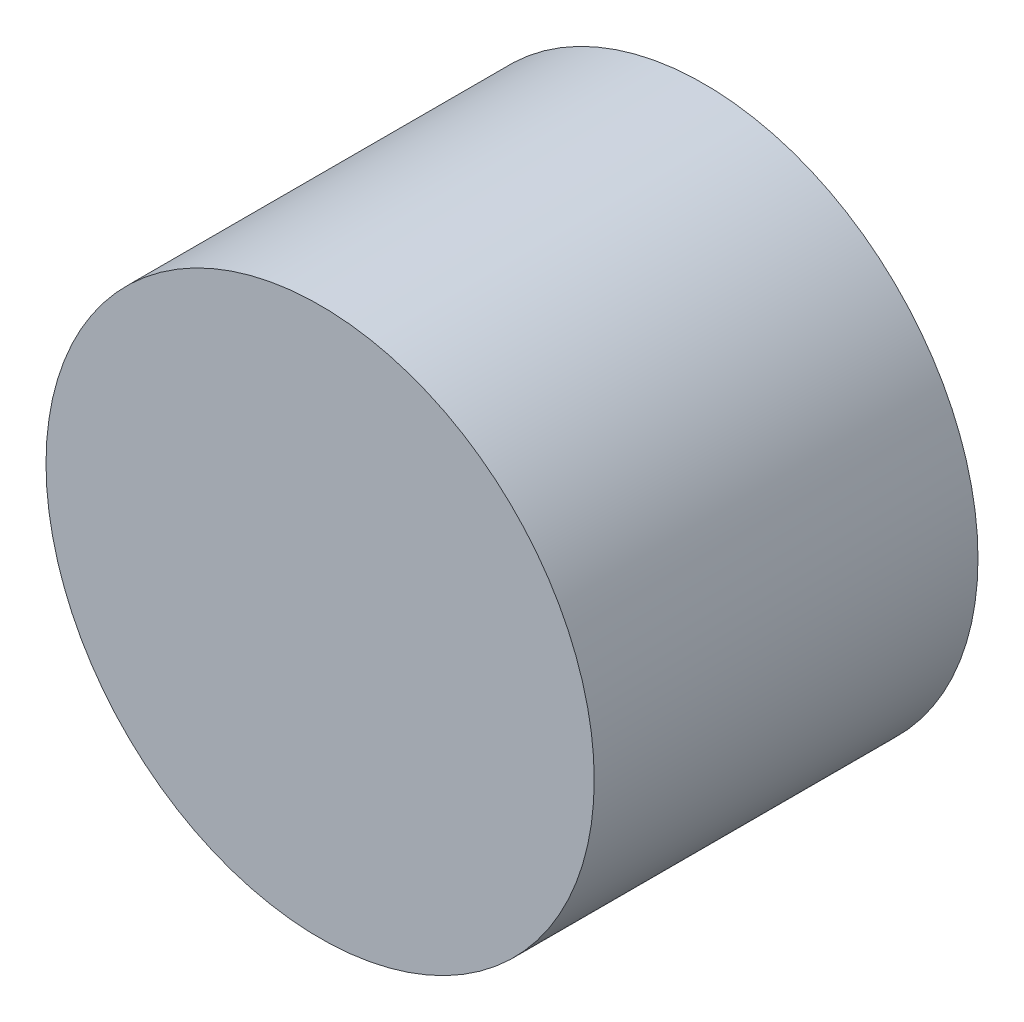
ISO-10303-21;
HEADER;
FILE_DESCRIPTION(('STEP AP214'),'2;1');
FILE_NAME('part.step','',(''),(''),'','','');
FILE_SCHEMA(('AUTOMOTIVE_DESIGN { 1 0 10303 214 1 1 1 1 }'));
ENDSEC;
DATA;
#1=APPLICATION_CONTEXT('core data for automotive mechanical design processes');
#2=APPLICATION_PROTOCOL_DEFINITION('international standard','automotive_design',2000,#1);
#3=PRODUCT_CONTEXT('',#1,'mechanical');
#4=PRODUCT('Part','Part','',(#3));
#5=PRODUCT_RELATED_PRODUCT_CATEGORY('part','',(#4));
#6=PRODUCT_DEFINITION_FORMATION('','',#4);
#7=PRODUCT_DEFINITION_CONTEXT('part definition',#1,'design');
#8=PRODUCT_DEFINITION('design','',#6,#7);
#9=PRODUCT_DEFINITION_SHAPE('','',#8);
#10=(LENGTH_UNIT() NAMED_UNIT(*) SI_UNIT(.MILLI.,.METRE.));
#11=(NAMED_UNIT(*) PLANE_ANGLE_UNIT() SI_UNIT($,.RADIAN.));
#12=(NAMED_UNIT(*) SI_UNIT($,.STERADIAN.) SOLID_ANGLE_UNIT());
#13=UNCERTAINTY_MEASURE_WITH_UNIT(LENGTH_MEASURE(1.E-05),#10,'distance_accuracy_value','');
#14=(GEOMETRIC_REPRESENTATION_CONTEXT(3) GLOBAL_UNCERTAINTY_ASSIGNED_CONTEXT((#13)) GLOBAL_UNIT_ASSIGNED_CONTEXT((#10,
#11,#12)) REPRESENTATION_CONTEXT('',''));
#15=CARTESIAN_POINT('',(0.,0.,0.));
#16=DIRECTION('',(0.,0.,1.));
#17=DIRECTION('',(1.,0.,0.));
#18=AXIS2_PLACEMENT_3D('',#15,#16,#17);
#19=CARTESIAN_POINT('',(0.,0.,0.));
#20=DIRECTION('',(0.,0.,-1.));
#21=DIRECTION('',(-1.,0.,0.));
#22=AXIS2_PLACEMENT_3D('',#19,#20,#21);
#23=CYLINDRICAL_SURFACE('',#22,1.55);
#24=CARTESIAN_POINT('',(0.,0.,-2.));
#25=DIRECTION('',(0.,0.,-1.));
#26=DIRECTION('',(-1.,0.,0.));
#27=AXIS2_PLACEMENT_3D('',#24,#25,#26);
#28=CIRCLE('',#27,1.55);
#29=CARTESIAN_POINT('',(-1.55,0.,-2.));
#30=VERTEX_POINT('',#29);
#31=EDGE_CURVE('E10',#30,#30,#28,.T.);
#32=ORIENTED_EDGE('',*,*,#31,.T.);
#33=EDGE_LOOP('',(#32));
#34=FACE_BOUND('',#33,.T.);
#35=CARTESIAN_POINT('',(0.,0.,5.));
#36=DIRECTION('',(0.,0.,-1.));
#37=DIRECTION('',(-1.,0.,0.));
#38=AXIS2_PLACEMENT_3D('',#35,#36,#37);
#39=CIRCLE('',#38,1.55);
#40=CARTESIAN_POINT('',(-1.55,0.,5.));
#41=VERTEX_POINT('',#40);
#42=EDGE_CURVE('E47',#41,#41,#39,.T.);
#43=ORIENTED_EDGE('',*,*,#42,.F.);
#44=EDGE_LOOP('',(#43));
#45=FACE_BOUND('',#44,.T.);
#46=ADVANCED_FACE('F33',(#34,#45),#23,.F.);
#47=CARTESIAN_POINT('',(0.,0.,-2.));
#48=DIRECTION('',(0.,0.,1.));
#49=DIRECTION('',(1.,0.,0.));
#50=AXIS2_PLACEMENT_3D('',#47,#48,#49);
#51=CONICAL_SURFACE('',#50,1.55,1.04542945297958);
#52=CARTESIAN_POINT('',(0.,0.,0.));
#53=DIRECTION('',(0.,0.,-1.));
#54=DIRECTION('',(-1.,0.,0.));
#55=AXIS2_PLACEMENT_3D('',#52,#53,#54);
#56=CIRCLE('',#55,5.);
#57=CARTESIAN_POINT('',(-5.,0.,0.));
#58=VERTEX_POINT('',#57);
#59=EDGE_CURVE('E39',#58,#58,#56,.T.);
#60=ORIENTED_EDGE('',*,*,#59,.T.);
#61=EDGE_LOOP('',(#60));
#62=FACE_BOUND('',#61,.T.);
#63=ORIENTED_EDGE('',*,*,#31,.F.);
#64=EDGE_LOOP('',(#63));
#65=FACE_BOUND('',#64,.T.);
#66=ADVANCED_FACE('F56',(#62,#65),#51,.T.);
#67=CARTESIAN_POINT('',(0.,0.,0.));
#68=DIRECTION('',(0.,0.,-1.));
#69=DIRECTION('',(-1.,0.,0.));
#70=AXIS2_PLACEMENT_3D('',#67,#68,#69);
#71=CYLINDRICAL_SURFACE('',#70,5.);
#72=CARTESIAN_POINT('',(0.,0.,7.));
#73=DIRECTION('',(0.,0.,-1.));
#74=DIRECTION('',(-1.,0.,0.));
#75=AXIS2_PLACEMENT_3D('',#72,#73,#74);
#76=CIRCLE('',#75,5.);
#77=CARTESIAN_POINT('',(-5.,0.,7.));
#78=VERTEX_POINT('',#77);
#79=EDGE_CURVE('E43',#78,#78,#76,.T.);
#80=ORIENTED_EDGE('',*,*,#79,.T.);
#81=EDGE_LOOP('',(#80));
#82=FACE_BOUND('',#81,.T.);
#83=ORIENTED_EDGE('',*,*,#59,.F.);
#84=EDGE_LOOP('',(#83));
#85=FACE_BOUND('',#84,.T.);
#86=ADVANCED_FACE('F60',(#82,#85),#71,.T.);
#87=CARTESIAN_POINT('',(0.,0.,7.));
#88=DIRECTION('',(0.,0.,-1.));
#89=DIRECTION('',(-1.,0.,0.));
#90=AXIS2_PLACEMENT_3D('',#87,#88,#89);
#91=PLANE('',#90);
#92=ORIENTED_EDGE('',*,*,#79,.F.);
#93=EDGE_LOOP('',(#92));
#94=FACE_BOUND('',#93,.T.);
#95=ADVANCED_FACE('F64',(#94),#91,.F.);
#96=CARTESIAN_POINT('',(0.,0.,5.));
#97=DIRECTION('',(0.,0.,1.));
#98=DIRECTION('',(1.,0.,0.));
#99=AXIS2_PLACEMENT_3D('',#96,#97,#98);
#100=PLANE('',#99);
#101=ORIENTED_EDGE('',*,*,#42,.T.);
#102=EDGE_LOOP('',(#101));
#103=FACE_BOUND('',#102,.T.);
#104=ADVANCED_FACE('F53',(#103),#100,.F.);
#105=CLOSED_SHELL('',(#46,#66,#86,#95,#104));
#106=MANIFOLD_SOLID_BREP('B2',#105);
#107=ADVANCED_BREP_SHAPE_REPRESENTATION('',(#18,#106),#14);
#108=SHAPE_DEFINITION_REPRESENTATION(#9,#107);
ENDSEC;
END-ISO-10303-21;
